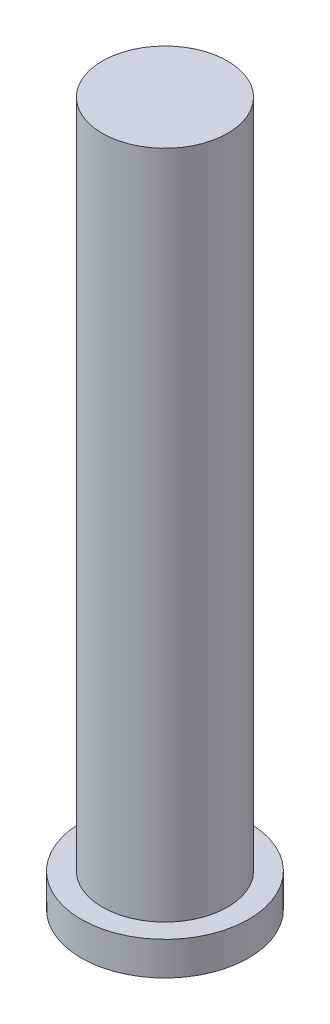
ISO-10303-21;
HEADER;
FILE_DESCRIPTION(('STEP AP214'),'2;1');
FILE_NAME('part.step','',(''),(''),'','','');
FILE_SCHEMA(('AUTOMOTIVE_DESIGN { 1 0 10303 214 1 1 1 1 }'));
ENDSEC;
DATA;
#1=APPLICATION_CONTEXT('core data for automotive mechanical design processes');
#2=APPLICATION_PROTOCOL_DEFINITION('international standard','automotive_design',2000,#1);
#3=PRODUCT_CONTEXT('',#1,'mechanical');
#4=PRODUCT('Part','Part','',(#3));
#5=PRODUCT_RELATED_PRODUCT_CATEGORY('part','',(#4));
#6=PRODUCT_DEFINITION_FORMATION('','',#4);
#7=PRODUCT_DEFINITION_CONTEXT('part definition',#1,'design');
#8=PRODUCT_DEFINITION('design','',#6,#7);
#9=PRODUCT_DEFINITION_SHAPE('','',#8);
#10=(LENGTH_UNIT() NAMED_UNIT(*) SI_UNIT(.MILLI.,.METRE.));
#11=(NAMED_UNIT(*) PLANE_ANGLE_UNIT() SI_UNIT($,.RADIAN.));
#12=(NAMED_UNIT(*) SI_UNIT($,.STERADIAN.) SOLID_ANGLE_UNIT());
#13=UNCERTAINTY_MEASURE_WITH_UNIT(LENGTH_MEASURE(1.E-05),#10,'distance_accuracy_value','');
#14=(GEOMETRIC_REPRESENTATION_CONTEXT(3) GLOBAL_UNCERTAINTY_ASSIGNED_CONTEXT((#13)) GLOBAL_UNIT_ASSIGNED_CONTEXT((#10,
#11,#12)) REPRESENTATION_CONTEXT('',''));
#15=CARTESIAN_POINT('',(0.,0.,0.));
#16=DIRECTION('',(0.,0.,1.));
#17=DIRECTION('',(1.,0.,0.));
#18=AXIS2_PLACEMENT_3D('',#15,#16,#17);
#19=CARTESIAN_POINT('',(0.,2.54,0.));
#20=DIRECTION('',(0.,-1.,0.));
#21=DIRECTION('',(0.,0.,-1.));
#22=AXIS2_PLACEMENT_3D('',#19,#20,#21);
#23=CYLINDRICAL_SURFACE('',#22,6.35);
#24=CARTESIAN_POINT('',(0.,2.54,0.));
#25=DIRECTION('',(0.,1.,0.));
#26=DIRECTION('',(0.,0.,1.));
#27=AXIS2_PLACEMENT_3D('',#24,#25,#26);
#28=CIRCLE('',#27,6.35);
#29=CARTESIAN_POINT('',(0.,2.54,6.35));
#30=VERTEX_POINT('',#29);
#31=EDGE_CURVE('E42',#30,#30,#28,.T.);
#32=ORIENTED_EDGE('',*,*,#31,.F.);
#33=EDGE_LOOP('',(#32));
#34=FACE_BOUND('',#33,.T.);
#35=CARTESIAN_POINT('',(0.,0.,0.));
#36=DIRECTION('',(0.,1.,0.));
#37=DIRECTION('',(0.,0.,1.));
#38=AXIS2_PLACEMENT_3D('',#35,#36,#37);
#39=CIRCLE('',#38,6.35);
#40=CARTESIAN_POINT('',(0.,0.,6.35));
#41=VERTEX_POINT('',#40);
#42=EDGE_CURVE('E38',#41,#41,#39,.T.);
#43=ORIENTED_EDGE('',*,*,#42,.T.);
#44=EDGE_LOOP('',(#43));
#45=FACE_BOUND('',#44,.T.);
#46=ADVANCED_FACE('F35',(#34,#45),#23,.T.);
#47=CARTESIAN_POINT('',(0.,2.54,0.));
#48=DIRECTION('',(0.,1.,0.));
#49=DIRECTION('',(0.,0.,1.));
#50=AXIS2_PLACEMENT_3D('',#47,#48,#49);
#51=PLANE('',#50);
#52=CARTESIAN_POINT('',(0.,2.54,0.));
#53=DIRECTION('',(0.,1.,0.));
#54=DIRECTION('',(0.,0.,1.));
#55=AXIS2_PLACEMENT_3D('',#52,#53,#54);
#56=CIRCLE('',#55,4.7498);
#57=CARTESIAN_POINT('',(0.,2.54,4.7498));
#58=VERTEX_POINT('',#57);
#59=EDGE_CURVE('E10',#58,#58,#56,.T.);
#60=ORIENTED_EDGE('',*,*,#59,.F.);
#61=EDGE_LOOP('',(#60));
#62=FACE_BOUND('',#61,.T.);
#63=ORIENTED_EDGE('',*,*,#31,.T.);
#64=EDGE_LOOP('',(#63));
#65=FACE_BOUND('',#64,.T.);
#66=ADVANCED_FACE('F59',(#62,#65),#51,.T.);
#67=CARTESIAN_POINT('',(0.,0.,0.));
#68=DIRECTION('',(0.,1.,0.));
#69=DIRECTION('',(0.,0.,1.));
#70=AXIS2_PLACEMENT_3D('',#67,#68,#69);
#71=PLANE('',#70);
#72=ORIENTED_EDGE('',*,*,#42,.F.);
#73=EDGE_LOOP('',(#72));
#74=FACE_BOUND('',#73,.T.);
#75=ADVANCED_FACE('F56',(#74),#71,.F.);
#76=CARTESIAN_POINT('',(0.,53.34,0.));
#77=DIRECTION('',(0.,-1.,0.));
#78=DIRECTION('',(0.,0.,-1.));
#79=AXIS2_PLACEMENT_3D('',#76,#77,#78);
#80=CYLINDRICAL_SURFACE('',#79,4.7498);
#81=CARTESIAN_POINT('',(0.,53.34,0.));
#82=DIRECTION('',(0.,1.,0.));
#83=DIRECTION('',(0.,0.,1.));
#84=AXIS2_PLACEMENT_3D('',#81,#82,#83);
#85=CIRCLE('',#84,4.7498);
#86=CARTESIAN_POINT('',(0.,53.34,4.7498));
#87=VERTEX_POINT('',#86);
#88=EDGE_CURVE('E48',#87,#87,#85,.T.);
#89=ORIENTED_EDGE('',*,*,#88,.F.);
#90=EDGE_LOOP('',(#89));
#91=FACE_BOUND('',#90,.T.);
#92=ORIENTED_EDGE('',*,*,#59,.T.);
#93=EDGE_LOOP('',(#92));
#94=FACE_BOUND('',#93,.T.);
#95=ADVANCED_FACE('F58',(#91,#94),#80,.T.);
#96=CARTESIAN_POINT('',(0.,53.34,0.));
#97=DIRECTION('',(0.,1.,0.));
#98=DIRECTION('',(0.,0.,1.));
#99=AXIS2_PLACEMENT_3D('',#96,#97,#98);
#100=PLANE('',#99);
#101=ORIENTED_EDGE('',*,*,#88,.T.);
#102=EDGE_LOOP('',(#101));
#103=FACE_BOUND('',#102,.T.);
#104=ADVANCED_FACE('F64',(#103),#100,.T.);
#105=CLOSED_SHELL('',(#46,#66,#75,#95,#104));
#106=MANIFOLD_SOLID_BREP('B2',#105);
#107=ADVANCED_BREP_SHAPE_REPRESENTATION('',(#18,#106),#14);
#108=SHAPE_DEFINITION_REPRESENTATION(#9,#107);
ENDSEC;
END-ISO-10303-21;
